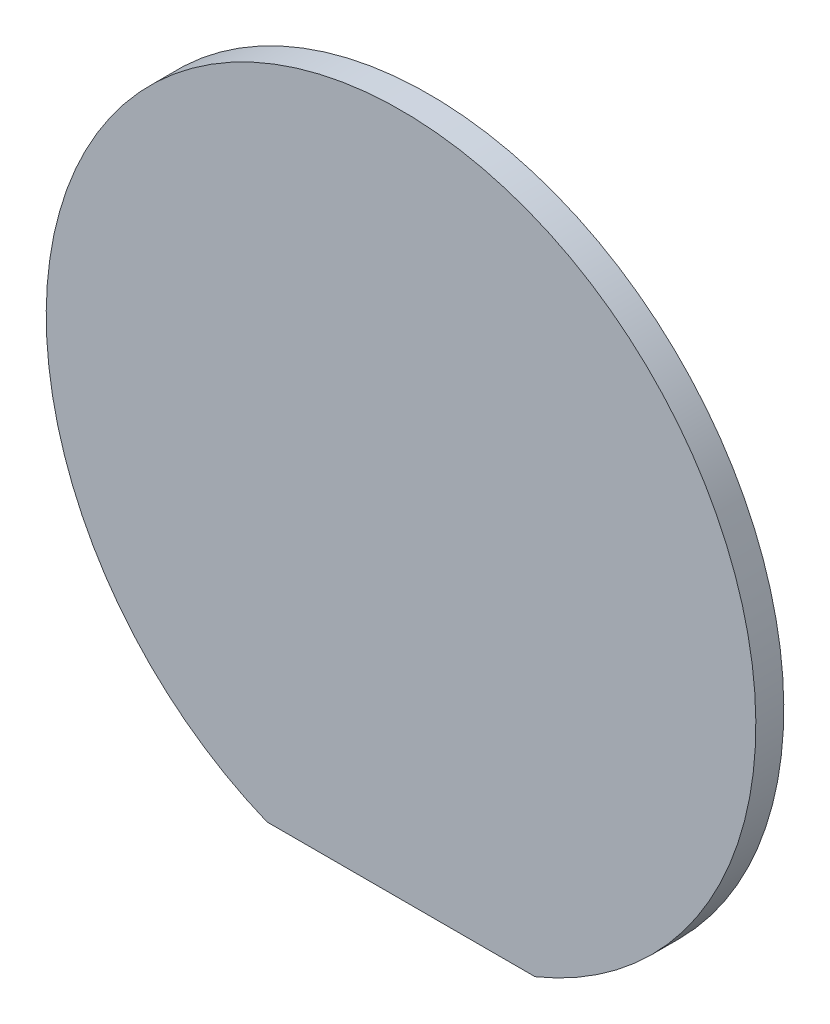
ISO-10303-21;
HEADER;
FILE_DESCRIPTION(('STEP AP214'),'2;1');
FILE_NAME('part.step','',(''),(''),'','','');
FILE_SCHEMA(('AUTOMOTIVE_DESIGN { 1 0 10303 214 1 1 1 1 }'));
ENDSEC;
DATA;
#1=APPLICATION_CONTEXT('core data for automotive mechanical design processes');
#2=APPLICATION_PROTOCOL_DEFINITION('international standard','automotive_design',2000,#1);
#3=PRODUCT_CONTEXT('',#1,'mechanical');
#4=PRODUCT('Part','Part','',(#3));
#5=PRODUCT_RELATED_PRODUCT_CATEGORY('part','',(#4));
#6=PRODUCT_DEFINITION_FORMATION('','',#4);
#7=PRODUCT_DEFINITION_CONTEXT('part definition',#1,'design');
#8=PRODUCT_DEFINITION('design','',#6,#7);
#9=PRODUCT_DEFINITION_SHAPE('','',#8);
#10=(LENGTH_UNIT() NAMED_UNIT(*) SI_UNIT(.MILLI.,.METRE.));
#11=(NAMED_UNIT(*) PLANE_ANGLE_UNIT() SI_UNIT($,.RADIAN.));
#12=(NAMED_UNIT(*) SI_UNIT($,.STERADIAN.) SOLID_ANGLE_UNIT());
#13=UNCERTAINTY_MEASURE_WITH_UNIT(LENGTH_MEASURE(1.E-05),#10,'distance_accuracy_value','');
#14=(GEOMETRIC_REPRESENTATION_CONTEXT(3) GLOBAL_UNCERTAINTY_ASSIGNED_CONTEXT((#13)) GLOBAL_UNIT_ASSIGNED_CONTEXT((#10,
#11,#12)) REPRESENTATION_CONTEXT('',''));
#15=CARTESIAN_POINT('',(0.,0.,0.));
#16=DIRECTION('',(0.,0.,1.));
#17=DIRECTION('',(1.,0.,0.));
#18=AXIS2_PLACEMENT_3D('',#15,#16,#17);
#19=CARTESIAN_POINT('',(0.,0.,1.));
#20=DIRECTION('',(0.,0.,-1.));
#21=DIRECTION('',(-1.,0.,0.));
#22=AXIS2_PLACEMENT_3D('',#19,#20,#21);
#23=CYLINDRICAL_SURFACE('',#22,12.7);
#24=CARTESIAN_POINT('',(0.,0.,1.));
#25=DIRECTION('',(0.,0.,1.));
#26=DIRECTION('',(1.,0.,0.));
#27=AXIS2_PLACEMENT_3D('',#24,#25,#26);
#28=CIRCLE('',#27,12.7);
#29=CARTESIAN_POINT('',(4.79503910307309,-11.76,1.));
#30=VERTEX_POINT('',#29);
#31=CARTESIAN_POINT('',(-4.79503910307309,-11.76,1.));
#32=VERTEX_POINT('',#31);
#33=EDGE_CURVE('E47',#30,#32,#28,.T.);
#34=ORIENTED_EDGE('',*,*,#33,.F.);
#35=DIRECTION('',(0.,0.,-1.));
#36=VECTOR('',#35,1.);
#37=CARTESIAN_POINT('',(4.79503910307309,-11.76,1.));
#38=LINE('',#37,#36);
#39=CARTESIAN_POINT('',(4.79503910307309,-11.76,0.));
#40=VERTEX_POINT('',#39);
#41=EDGE_CURVE('E61',#30,#40,#38,.T.);
#42=ORIENTED_EDGE('',*,*,#41,.T.);
#43=CARTESIAN_POINT('',(0.,0.,0.));
#44=DIRECTION('',(0.,0.,1.));
#45=DIRECTION('',(1.,0.,0.));
#46=AXIS2_PLACEMENT_3D('',#43,#44,#45);
#47=CIRCLE('',#46,12.7);
#48=CARTESIAN_POINT('',(-4.79503910307309,-11.76,0.));
#49=VERTEX_POINT('',#48);
#50=EDGE_CURVE('E70',#40,#49,#47,.T.);
#51=ORIENTED_EDGE('',*,*,#50,.T.);
#52=DIRECTION('',(0.,0.,-1.));
#53=VECTOR('',#52,1.);
#54=CARTESIAN_POINT('',(-4.79503910307309,-11.76,1.));
#55=LINE('',#54,#53);
#56=EDGE_CURVE('E54',#49,#32,#55,.F.);
#57=ORIENTED_EDGE('',*,*,#56,.T.);
#58=EDGE_LOOP('',(#34,#42,#51,#57));
#59=FACE_BOUND('',#58,.T.);
#60=ADVANCED_FACE('F39',(#59),#23,.T.);
#61=CARTESIAN_POINT('',(0.,0.,1.));
#62=DIRECTION('',(0.,0.,1.));
#63=DIRECTION('',(1.,0.,0.));
#64=AXIS2_PLACEMENT_3D('',#61,#62,#63);
#65=PLANE('',#64);
#66=DIRECTION('',(-1.,0.,0.));
#67=VECTOR('',#66,1.);
#68=CARTESIAN_POINT('',(-5.88733807369101,-11.76,1.));
#69=LINE('',#68,#67);
#70=EDGE_CURVE('E64',#30,#32,#69,.T.);
#71=ORIENTED_EDGE('',*,*,#70,.F.);
#72=ORIENTED_EDGE('',*,*,#33,.T.);
#73=EDGE_LOOP('',(#71,#72));
#74=FACE_BOUND('',#73,.T.);
#75=ADVANCED_FACE('F74',(#74),#65,.T.);
#76=CARTESIAN_POINT('',(0.,0.,0.));
#77=DIRECTION('',(0.,0.,1.));
#78=DIRECTION('',(1.,0.,0.));
#79=AXIS2_PLACEMENT_3D('',#76,#77,#78);
#80=PLANE('',#79);
#81=ORIENTED_EDGE('',*,*,#50,.F.);
#82=DIRECTION('',(-1.,0.,0.));
#83=VECTOR('',#82,1.);
#84=CARTESIAN_POINT('',(0.,-11.76,0.));
#85=LINE('',#84,#83);
#86=EDGE_CURVE('E11',#40,#49,#85,.T.);
#87=ORIENTED_EDGE('',*,*,#86,.T.);
#88=EDGE_LOOP('',(#81,#87));
#89=FACE_BOUND('',#88,.T.);
#90=ADVANCED_FACE('F83',(#89),#80,.F.);
#91=CARTESIAN_POINT('',(-5.88733807369101,-11.76,0.));
#92=DIRECTION('',(0.,1.,0.));
#93=DIRECTION('',(0.,0.,1.));
#94=AXIS2_PLACEMENT_3D('',#91,#92,#93);
#95=PLANE('',#94);
#96=ORIENTED_EDGE('',*,*,#70,.T.);
#97=ORIENTED_EDGE('',*,*,#56,.F.);
#98=ORIENTED_EDGE('',*,*,#86,.F.);
#99=ORIENTED_EDGE('',*,*,#41,.F.);
#100=EDGE_LOOP('',(#96,#97,#98,#99));
#101=FACE_BOUND('',#100,.T.);
#102=ADVANCED_FACE('F63',(#101),#95,.F.);
#103=CLOSED_SHELL('',(#60,#75,#90,#102));
#104=MANIFOLD_SOLID_BREP('B2',#103);
#105=ADVANCED_BREP_SHAPE_REPRESENTATION('',(#18,#104),#14);
#106=SHAPE_DEFINITION_REPRESENTATION(#9,#105);
ENDSEC;
END-ISO-10303-21;
